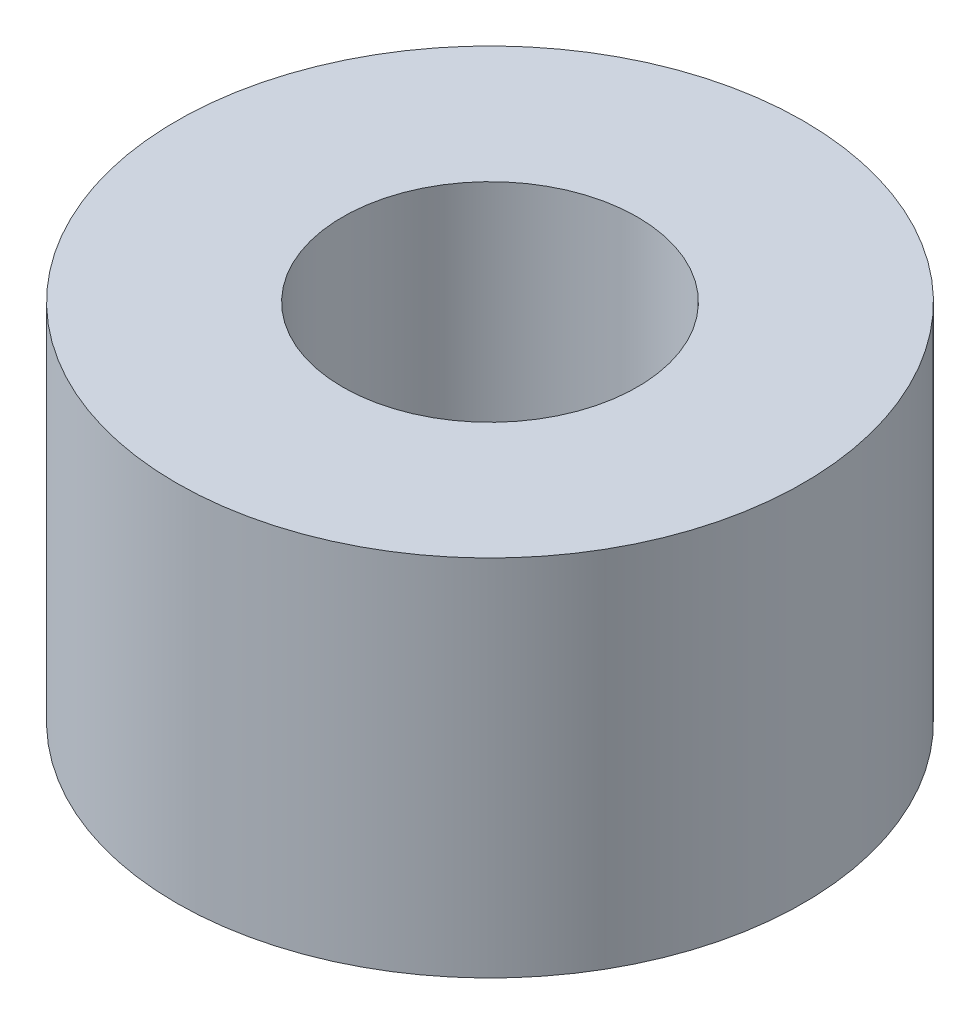
ISO-10303-21;
HEADER;
FILE_DESCRIPTION(('STEP AP214'),'2;1');
FILE_NAME('part.step','',(''),(''),'','','');
FILE_SCHEMA(('AUTOMOTIVE_DESIGN { 1 0 10303 214 1 1 1 1 }'));
ENDSEC;
DATA;
#1=APPLICATION_CONTEXT('core data for automotive mechanical design processes');
#2=APPLICATION_PROTOCOL_DEFINITION('international standard','automotive_design',2000,#1);
#3=PRODUCT_CONTEXT('',#1,'mechanical');
#4=PRODUCT('Part','Part','',(#3));
#5=PRODUCT_RELATED_PRODUCT_CATEGORY('part','',(#4));
#6=PRODUCT_DEFINITION_FORMATION('','',#4);
#7=PRODUCT_DEFINITION_CONTEXT('part definition',#1,'design');
#8=PRODUCT_DEFINITION('design','',#6,#7);
#9=PRODUCT_DEFINITION_SHAPE('','',#8);
#10=(LENGTH_UNIT() NAMED_UNIT(*) SI_UNIT(.MILLI.,.METRE.));
#11=(NAMED_UNIT(*) PLANE_ANGLE_UNIT() SI_UNIT($,.RADIAN.));
#12=(NAMED_UNIT(*) SI_UNIT($,.STERADIAN.) SOLID_ANGLE_UNIT());
#13=UNCERTAINTY_MEASURE_WITH_UNIT(LENGTH_MEASURE(1.E-05),#10,'distance_accuracy_value','');
#14=(GEOMETRIC_REPRESENTATION_CONTEXT(3) GLOBAL_UNCERTAINTY_ASSIGNED_CONTEXT((#13)) GLOBAL_UNIT_ASSIGNED_CONTEXT((#10,
#11,#12)) REPRESENTATION_CONTEXT('',''));
#15=CARTESIAN_POINT('',(0.,0.,0.));
#16=DIRECTION('',(0.,0.,1.));
#17=DIRECTION('',(1.,0.,0.));
#18=AXIS2_PLACEMENT_3D('',#15,#16,#17);
#19=CARTESIAN_POINT('',(0.,2.9,0.));
#20=DIRECTION('',(0.,1.,0.));
#21=DIRECTION('',(0.,0.,1.));
#22=AXIS2_PLACEMENT_3D('',#19,#20,#21);
#23=PLANE('',#22);
#24=CARTESIAN_POINT('',(0.,2.9,0.));
#25=DIRECTION('',(0.,1.,0.));
#26=DIRECTION('',(0.,0.,1.));
#27=AXIS2_PLACEMENT_3D('',#24,#25,#26);
#28=CIRCLE('',#27,2.5);
#29=CARTESIAN_POINT('',(0.,2.9,2.5));
#30=VERTEX_POINT('',#29);
#31=EDGE_CURVE('E10',#30,#30,#28,.T.);
#32=ORIENTED_EDGE('',*,*,#31,.T.);
#33=EDGE_LOOP('',(#32));
#34=FACE_BOUND('',#33,.T.);
#35=CARTESIAN_POINT('',(0.,2.9,0.));
#36=DIRECTION('',(0.,1.,0.));
#37=DIRECTION('',(0.,0.,1.));
#38=AXIS2_PLACEMENT_3D('',#35,#36,#37);
#39=CIRCLE('',#38,1.175);
#40=CARTESIAN_POINT('',(0.,2.9,1.175));
#41=VERTEX_POINT('',#40);
#42=EDGE_CURVE('E42',#41,#41,#39,.T.);
#43=ORIENTED_EDGE('',*,*,#42,.F.);
#44=EDGE_LOOP('',(#43));
#45=FACE_BOUND('',#44,.T.);
#46=ADVANCED_FACE('F31',(#34,#45),#23,.T.);
#47=CARTESIAN_POINT('',(0.,0.,0.));
#48=DIRECTION('',(0.,1.,0.));
#49=DIRECTION('',(0.,0.,1.));
#50=AXIS2_PLACEMENT_3D('',#47,#48,#49);
#51=PLANE('',#50);
#52=CARTESIAN_POINT('',(0.,0.,0.));
#53=DIRECTION('',(0.,1.,0.));
#54=DIRECTION('',(0.,0.,1.));
#55=AXIS2_PLACEMENT_3D('',#52,#53,#54);
#56=CIRCLE('',#55,2.5);
#57=CARTESIAN_POINT('',(0.,0.,2.5));
#58=VERTEX_POINT('',#57);
#59=EDGE_CURVE('E35',#58,#58,#56,.T.);
#60=ORIENTED_EDGE('',*,*,#59,.F.);
#61=EDGE_LOOP('',(#60));
#62=FACE_BOUND('',#61,.T.);
#63=CARTESIAN_POINT('',(0.,0.,0.));
#64=DIRECTION('',(0.,1.,0.));
#65=DIRECTION('',(0.,0.,1.));
#66=AXIS2_PLACEMENT_3D('',#63,#64,#65);
#67=CIRCLE('',#66,1.175);
#68=CARTESIAN_POINT('',(0.,0.,1.175));
#69=VERTEX_POINT('',#68);
#70=EDGE_CURVE('E44',#69,#69,#67,.T.);
#71=ORIENTED_EDGE('',*,*,#70,.T.);
#72=EDGE_LOOP('',(#71));
#73=FACE_BOUND('',#72,.T.);
#74=ADVANCED_FACE('F54',(#62,#73),#51,.F.);
#75=CARTESIAN_POINT('',(0.,2.9,0.));
#76=DIRECTION('',(0.,-1.,0.));
#77=DIRECTION('',(0.,0.,-1.));
#78=AXIS2_PLACEMENT_3D('',#75,#76,#77);
#79=CYLINDRICAL_SURFACE('',#78,2.5);
#80=ORIENTED_EDGE('',*,*,#31,.F.);
#81=EDGE_LOOP('',(#80));
#82=FACE_BOUND('',#81,.T.);
#83=ORIENTED_EDGE('',*,*,#59,.T.);
#84=EDGE_LOOP('',(#83));
#85=FACE_BOUND('',#84,.T.);
#86=ADVANCED_FACE('F33',(#82,#85),#79,.T.);
#87=CARTESIAN_POINT('',(0.,2.9,0.));
#88=DIRECTION('',(0.,-1.,0.));
#89=DIRECTION('',(0.,0.,-1.));
#90=AXIS2_PLACEMENT_3D('',#87,#88,#89);
#91=CYLINDRICAL_SURFACE('',#90,1.175);
#92=ORIENTED_EDGE('',*,*,#42,.T.);
#93=EDGE_LOOP('',(#92));
#94=FACE_BOUND('',#93,.T.);
#95=ORIENTED_EDGE('',*,*,#70,.F.);
#96=EDGE_LOOP('',(#95));
#97=FACE_BOUND('',#96,.T.);
#98=ADVANCED_FACE('F50',(#94,#97),#91,.F.);
#99=CLOSED_SHELL('',(#46,#74,#86,#98));
#100=MANIFOLD_SOLID_BREP('B2',#99);
#101=ADVANCED_BREP_SHAPE_REPRESENTATION('',(#18,#100),#14);
#102=SHAPE_DEFINITION_REPRESENTATION(#9,#101);
ENDSEC;
END-ISO-10303-21;
